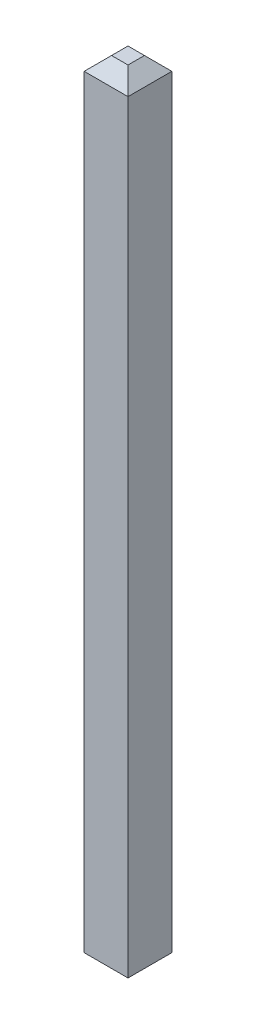
ISO-10303-21;
HEADER;
FILE_DESCRIPTION(('STEP AP214'),'2;1');
FILE_NAME('part.step','',(''),(''),'','','');
FILE_SCHEMA(('AUTOMOTIVE_DESIGN { 1 0 10303 214 1 1 1 1 }'));
ENDSEC;
DATA;
#1=APPLICATION_CONTEXT('core data for automotive mechanical design processes');
#2=APPLICATION_PROTOCOL_DEFINITION('international standard','automotive_design',2000,#1);
#3=PRODUCT_CONTEXT('',#1,'mechanical');
#4=PRODUCT('Part','Part','',(#3));
#5=PRODUCT_RELATED_PRODUCT_CATEGORY('part','',(#4));
#6=PRODUCT_DEFINITION_FORMATION('','',#4);
#7=PRODUCT_DEFINITION_CONTEXT('part definition',#1,'design');
#8=PRODUCT_DEFINITION('design','',#6,#7);
#9=PRODUCT_DEFINITION_SHAPE('','',#8);
#10=(LENGTH_UNIT() NAMED_UNIT(*) SI_UNIT(.MILLI.,.METRE.));
#11=(NAMED_UNIT(*) PLANE_ANGLE_UNIT() SI_UNIT($,.RADIAN.));
#12=(NAMED_UNIT(*) SI_UNIT($,.STERADIAN.) SOLID_ANGLE_UNIT());
#13=UNCERTAINTY_MEASURE_WITH_UNIT(LENGTH_MEASURE(1.E-05),#10,'distance_accuracy_value','');
#14=(GEOMETRIC_REPRESENTATION_CONTEXT(3) GLOBAL_UNCERTAINTY_ASSIGNED_CONTEXT((#13)) GLOBAL_UNIT_ASSIGNED_CONTEXT((#10,
#11,#12)) REPRESENTATION_CONTEXT('',''));
#15=CARTESIAN_POINT('',(0.,0.,0.));
#16=DIRECTION('',(0.,0.,1.));
#17=DIRECTION('',(1.,0.,0.));
#18=AXIS2_PLACEMENT_3D('',#15,#16,#17);
#19=CARTESIAN_POINT('',(9.21,7.07,-0.32));
#20=DIRECTION('',(-0.707106781186548,-0.707106781186548,0.));
#21=DIRECTION('',(-0.707106781186548,0.707106781186548,0.));
#22=AXIS2_PLACEMENT_3D('',#19,#20,#21);
#23=PLANE('',#22);
#24=DIRECTION('',(0.577350269189626,-0.577350269189626,0.577350269189626));
#25=VECTOR('',#24,1.);
#26=CARTESIAN_POINT('',(8.996666666667,7.283333333333,0.106666666667));
#27=LINE('',#26,#25);
#28=CARTESIAN_POINT('',(9.01,7.27,0.12));
#29=VERTEX_POINT('',#28);
#30=CARTESIAN_POINT('',(9.21,7.07,0.32));
#31=VERTEX_POINT('',#30);
#32=EDGE_CURVE('E81',#29,#31,#27,.T.);
#33=ORIENTED_EDGE('',*,*,#32,.T.);
#34=DIRECTION('',(0.,0.,1.));
#35=VECTOR('',#34,1.);
#36=CARTESIAN_POINT('',(9.21,7.07,-0.32));
#37=LINE('',#36,#35);
#38=CARTESIAN_POINT('',(9.21,7.07,-0.32));
#39=VERTEX_POINT('',#38);
#40=EDGE_CURVE('E145',#39,#31,#37,.T.);
#41=ORIENTED_EDGE('',*,*,#40,.F.);
#42=DIRECTION('',(0.577350269189626,-0.577350269189626,-0.577350269189626));
#43=VECTOR('',#42,1.);
#44=CARTESIAN_POINT('',(9.21,7.07,-0.32));
#45=LINE('',#44,#43);
#46=CARTESIAN_POINT('',(9.01,7.27,-0.12));
#47=VERTEX_POINT('',#46);
#48=EDGE_CURVE('E11',#47,#39,#45,.T.);
#49=ORIENTED_EDGE('',*,*,#48,.F.);
#50=DIRECTION('',(0.,0.,-1.));
#51=VECTOR('',#50,1.);
#52=CARTESIAN_POINT('',(9.01,7.27,-0.32));
#53=LINE('',#52,#51);
#54=EDGE_CURVE('E172',#29,#47,#53,.T.);
#55=ORIENTED_EDGE('',*,*,#54,.F.);
#56=EDGE_LOOP('',(#33,#41,#49,#55));
#57=FACE_BOUND('',#56,.T.);
#58=ADVANCED_FACE('F17',(#57),#23,.F.);
#59=CARTESIAN_POINT('',(8.89,7.07,-0.32));
#60=DIRECTION('',(0.,0.707106781186548,-0.707106781186548));
#61=DIRECTION('',(-1.,0.,0.));
#62=AXIS2_PLACEMENT_3D('',#59,#60,#61);
#63=PLANE('',#62);
#64=DIRECTION('',(0.577350269189626,0.577350269189626,0.577350269189626));
#65=VECTOR('',#64,1.);
#66=CARTESIAN_POINT('',(8.703333333333,7.203333333333,-0.186666666667));
#67=LINE('',#66,#65);
#68=CARTESIAN_POINT('',(8.57,7.07,-0.32));
#69=VERTEX_POINT('',#68);
#70=CARTESIAN_POINT('',(8.77,7.27,-0.12));
#71=VERTEX_POINT('',#70);
#72=EDGE_CURVE('E25',#69,#71,#67,.T.);
#73=ORIENTED_EDGE('',*,*,#72,.T.);
#74=DIRECTION('',(-1.,0.,0.));
#75=VECTOR('',#74,1.);
#76=CARTESIAN_POINT('',(8.57,7.27,-0.12));
#77=LINE('',#76,#75);
#78=EDGE_CURVE('E167',#47,#71,#77,.T.);
#79=ORIENTED_EDGE('',*,*,#78,.F.);
#80=ORIENTED_EDGE('',*,*,#48,.T.);
#81=DIRECTION('',(1.,0.,0.));
#82=VECTOR('',#81,1.);
#83=CARTESIAN_POINT('',(9.21,7.07,-0.32));
#84=LINE('',#83,#82);
#85=EDGE_CURVE('E164',#69,#39,#84,.T.);
#86=ORIENTED_EDGE('',*,*,#85,.F.);
#87=EDGE_LOOP('',(#73,#79,#80,#86));
#88=FACE_BOUND('',#87,.T.);
#89=ADVANCED_FACE('F318',(#88),#63,.T.);
#90=CARTESIAN_POINT('',(8.77,7.27,-0.32));
#91=DIRECTION('',(0.707106781186548,-0.707106781186548,0.));
#92=DIRECTION('',(0.,0.,-1.));
#93=AXIS2_PLACEMENT_3D('',#90,#91,#92);
#94=PLANE('',#93);
#95=DIRECTION('',(-0.577350269189626,-0.577350269189626,0.577350269189626));
#96=VECTOR('',#95,1.);
#97=CARTESIAN_POINT('',(8.703333333333,7.203333333333,0.186666666667));
#98=LINE('',#97,#96);
#99=CARTESIAN_POINT('',(8.77,7.27,0.12));
#100=VERTEX_POINT('',#99);
#101=CARTESIAN_POINT('',(8.57,7.07,0.32));
#102=VERTEX_POINT('',#101);
#103=EDGE_CURVE('E37',#100,#102,#98,.T.);
#104=ORIENTED_EDGE('',*,*,#103,.F.);
#105=DIRECTION('',(0.,0.,1.));
#106=VECTOR('',#105,1.);
#107=CARTESIAN_POINT('',(8.77,7.27,-0.32));
#108=LINE('',#107,#106);
#109=EDGE_CURVE('E186',#71,#100,#108,.T.);
#110=ORIENTED_EDGE('',*,*,#109,.F.);
#111=ORIENTED_EDGE('',*,*,#72,.F.);
#112=DIRECTION('',(0.,0.,-1.));
#113=VECTOR('',#112,1.);
#114=CARTESIAN_POINT('',(8.57,7.07,-0.32));
#115=LINE('',#114,#113);
#116=EDGE_CURVE('E148',#102,#69,#115,.T.);
#117=ORIENTED_EDGE('',*,*,#116,.F.);
#118=EDGE_LOOP('',(#104,#110,#111,#117));
#119=FACE_BOUND('',#118,.T.);
#120=ADVANCED_FACE('F149',(#119),#94,.F.);
#121=CARTESIAN_POINT('',(8.57,7.27,0.12));
#122=DIRECTION('',(0.,-0.707106781186548,-0.707106781186548));
#123=DIRECTION('',(0.,-0.707106781186548,0.707106781186548));
#124=AXIS2_PLACEMENT_3D('',#121,#122,#123);
#125=PLANE('',#124);
#126=ORIENTED_EDGE('',*,*,#32,.F.);
#127=DIRECTION('',(1.,0.,0.));
#128=VECTOR('',#127,1.);
#129=CARTESIAN_POINT('',(8.57,7.27,0.12));
#130=LINE('',#129,#128);
#131=EDGE_CURVE('E133',#100,#29,#130,.T.);
#132=ORIENTED_EDGE('',*,*,#131,.F.);
#133=ORIENTED_EDGE('',*,*,#103,.T.);
#134=DIRECTION('',(-1.,0.,0.));
#135=VECTOR('',#134,1.);
#136=CARTESIAN_POINT('',(8.89,7.07,0.32));
#137=LINE('',#136,#135);
#138=EDGE_CURVE('E131',#31,#102,#137,.T.);
#139=ORIENTED_EDGE('',*,*,#138,.F.);
#140=EDGE_LOOP('',(#126,#132,#133,#139));
#141=FACE_BOUND('',#140,.T.);
#142=ADVANCED_FACE('F130',(#141),#125,.F.);
#143=CARTESIAN_POINT('',(8.57,7.27,-0.32));
#144=DIRECTION('',(0.,-1.,0.));
#145=DIRECTION('',(0.,0.,-1.));
#146=AXIS2_PLACEMENT_3D('',#143,#144,#145);
#147=PLANE('',#146);
#148=ORIENTED_EDGE('',*,*,#54,.T.);
#149=ORIENTED_EDGE('',*,*,#78,.T.);
#150=ORIENTED_EDGE('',*,*,#109,.T.);
#151=ORIENTED_EDGE('',*,*,#131,.T.);
#152=EDGE_LOOP('',(#148,#149,#150,#151));
#153=FACE_BOUND('',#152,.T.);
#154=ADVANCED_FACE('F245',(#153),#147,.F.);
#155=CARTESIAN_POINT('',(9.21,7.27,-0.32));
#156=DIRECTION('',(-1.,0.,0.));
#157=DIRECTION('',(0.,1.,0.));
#158=AXIS2_PLACEMENT_3D('',#155,#156,#157);
#159=PLANE('',#158);
#160=DIRECTION('',(0.,-1.,0.));
#161=VECTOR('',#160,1.);
#162=CARTESIAN_POINT('',(9.21,7.27,-0.32));
#163=LINE('',#162,#161);
#164=CARTESIAN_POINT('',(9.21,-4.07,-0.32));
#165=VERTEX_POINT('',#164);
#166=EDGE_CURVE('E158',#39,#165,#163,.T.);
#167=ORIENTED_EDGE('',*,*,#166,.F.);
#168=ORIENTED_EDGE('',*,*,#40,.T.);
#169=DIRECTION('',(0.,-1.,0.));
#170=VECTOR('',#169,1.);
#171=CARTESIAN_POINT('',(9.21,7.27,0.32));
#172=LINE('',#171,#170);
#173=CARTESIAN_POINT('',(9.21,-4.07,0.32));
#174=VERTEX_POINT('',#173);
#175=EDGE_CURVE('E143',#31,#174,#172,.T.);
#176=ORIENTED_EDGE('',*,*,#175,.T.);
#177=DIRECTION('',(0.,0.,-1.));
#178=VECTOR('',#177,1.);
#179=CARTESIAN_POINT('',(9.21,-4.07,-0.32));
#180=LINE('',#179,#178);
#181=EDGE_CURVE('E178',#174,#165,#180,.T.);
#182=ORIENTED_EDGE('',*,*,#181,.T.);
#183=EDGE_LOOP('',(#167,#168,#176,#182));
#184=FACE_BOUND('',#183,.T.);
#185=ADVANCED_FACE('F205',(#184),#159,.F.);
#186=CARTESIAN_POINT('',(8.89,1.5,0.32));
#187=DIRECTION('',(0.,0.,-1.));
#188=DIRECTION('',(0.,-1.,0.));
#189=AXIS2_PLACEMENT_3D('',#186,#187,#188);
#190=PLANE('',#189);
#191=ORIENTED_EDGE('',*,*,#175,.F.);
#192=ORIENTED_EDGE('',*,*,#138,.T.);
#193=DIRECTION('',(0.,1.,0.));
#194=VECTOR('',#193,1.);
#195=CARTESIAN_POINT('',(8.57,-4.27,0.32));
#196=LINE('',#195,#194);
#197=CARTESIAN_POINT('',(8.57,-4.07,0.32));
#198=VERTEX_POINT('',#197);
#199=EDGE_CURVE('E142',#198,#102,#196,.T.);
#200=ORIENTED_EDGE('',*,*,#199,.F.);
#201=DIRECTION('',(1.,0.,0.));
#202=VECTOR('',#201,1.);
#203=CARTESIAN_POINT('',(8.89,-4.07,0.32));
#204=LINE('',#203,#202);
#205=EDGE_CURVE('E175',#198,#174,#204,.T.);
#206=ORIENTED_EDGE('',*,*,#205,.T.);
#207=EDGE_LOOP('',(#191,#192,#200,#206));
#208=FACE_BOUND('',#207,.T.);
#209=ADVANCED_FACE('F139',(#208),#190,.F.);
#210=CARTESIAN_POINT('',(9.01,-4.27,-0.32));
#211=DIRECTION('',(-0.707106781186548,0.707106781186548,0.));
#212=DIRECTION('',(0.,0.,1.));
#213=AXIS2_PLACEMENT_3D('',#210,#211,#212);
#214=PLANE('',#213);
#215=DIRECTION('',(-0.577350269189626,-0.577350269189626,0.577350269189626));
#216=VECTOR('',#215,1.);
#217=CARTESIAN_POINT('',(9.076666666667,-4.203333333333,-0.186666666667));
#218=LINE('',#217,#216);
#219=CARTESIAN_POINT('',(9.01,-4.27,-0.12));
#220=VERTEX_POINT('',#219);
#221=EDGE_CURVE('E122',#165,#220,#218,.T.);
#222=ORIENTED_EDGE('',*,*,#221,.F.);
#223=ORIENTED_EDGE('',*,*,#181,.F.);
#224=DIRECTION('',(-0.577350269189626,-0.577350269189626,-0.577350269189626));
#225=VECTOR('',#224,1.);
#226=CARTESIAN_POINT('',(8.863333333333,-4.416666666667,-0.02666666666667));
#227=LINE('',#226,#225);
#228=CARTESIAN_POINT('',(9.01,-4.27,0.12));
#229=VERTEX_POINT('',#228);
#230=EDGE_CURVE('E114',#174,#229,#227,.T.);
#231=ORIENTED_EDGE('',*,*,#230,.T.);
#232=DIRECTION('',(0.,0.,1.));
#233=VECTOR('',#232,1.);
#234=CARTESIAN_POINT('',(9.01,-4.27,-0.32));
#235=LINE('',#234,#233);
#236=EDGE_CURVE('E397',#220,#229,#235,.T.);
#237=ORIENTED_EDGE('',*,*,#236,.F.);
#238=EDGE_LOOP('',(#222,#223,#231,#237));
#239=FACE_BOUND('',#238,.T.);
#240=ADVANCED_FACE('F204',(#239),#214,.F.);
#241=CARTESIAN_POINT('',(9.21,-4.27,0.12));
#242=DIRECTION('',(0.,0.707106781186548,-0.707106781186548));
#243=DIRECTION('',(-1.,0.,0.));
#244=AXIS2_PLACEMENT_3D('',#241,#242,#243);
#245=PLANE('',#244);
#246=ORIENTED_EDGE('',*,*,#230,.F.);
#247=ORIENTED_EDGE('',*,*,#205,.F.);
#248=DIRECTION('',(-0.577350269189626,0.577350269189626,0.577350269189626));
#249=VECTOR('',#248,1.);
#250=CARTESIAN_POINT('',(8.783333333333,-4.283333333333,0.106666666667));
#251=LINE('',#250,#249);
#252=CARTESIAN_POINT('',(8.77,-4.27,0.12));
#253=VERTEX_POINT('',#252);
#254=EDGE_CURVE('E103',#253,#198,#251,.T.);
#255=ORIENTED_EDGE('',*,*,#254,.F.);
#256=DIRECTION('',(-1.,0.,0.));
#257=VECTOR('',#256,1.);
#258=CARTESIAN_POINT('',(9.21,-4.27,0.12));
#259=LINE('',#258,#257);
#260=EDGE_CURVE('E392',#229,#253,#259,.T.);
#261=ORIENTED_EDGE('',*,*,#260,.F.);
#262=EDGE_LOOP('',(#246,#247,#255,#261));
#263=FACE_BOUND('',#262,.T.);
#264=ADVANCED_FACE('F220',(#263),#245,.F.);
#265=CARTESIAN_POINT('',(8.57,-4.07,-0.32));
#266=DIRECTION('',(0.707106781186548,0.707106781186548,0.));
#267=DIRECTION('',(0.,0.,-1.));
#268=AXIS2_PLACEMENT_3D('',#265,#266,#267);
#269=PLANE('',#268);
#270=DIRECTION('',(0.577350269189626,-0.577350269189626,0.577350269189626));
#271=VECTOR('',#270,1.);
#272=CARTESIAN_POINT('',(8.676666666667,-4.176666666667,-0.213333333333));
#273=LINE('',#272,#271);
#274=CARTESIAN_POINT('',(8.57,-4.07,-0.32));
#275=VERTEX_POINT('',#274);
#276=CARTESIAN_POINT('',(8.77,-4.27,-0.12));
#277=VERTEX_POINT('',#276);
#278=EDGE_CURVE('E375',#275,#277,#273,.T.);
#279=ORIENTED_EDGE('',*,*,#278,.T.);
#280=DIRECTION('',(0.,0.,-1.));
#281=VECTOR('',#280,1.);
#282=CARTESIAN_POINT('',(8.77,-4.27,-0.32));
#283=LINE('',#282,#281);
#284=EDGE_CURVE('E385',#253,#277,#283,.T.);
#285=ORIENTED_EDGE('',*,*,#284,.F.);
#286=ORIENTED_EDGE('',*,*,#254,.T.);
#287=DIRECTION('',(0.,0.,1.));
#288=VECTOR('',#287,1.);
#289=CARTESIAN_POINT('',(8.57,-4.07,-0.32));
#290=LINE('',#289,#288);
#291=EDGE_CURVE('E153',#275,#198,#290,.T.);
#292=ORIENTED_EDGE('',*,*,#291,.F.);
#293=EDGE_LOOP('',(#279,#285,#286,#292));
#294=FACE_BOUND('',#293,.T.);
#295=ADVANCED_FACE('F215',(#294),#269,.F.);
#296=CARTESIAN_POINT('',(8.57,-4.27,-0.32));
#297=DIRECTION('',(1.,0.,0.));
#298=DIRECTION('',(0.,0.,1.));
#299=AXIS2_PLACEMENT_3D('',#296,#297,#298);
#300=PLANE('',#299);
#301=ORIENTED_EDGE('',*,*,#199,.T.);
#302=ORIENTED_EDGE('',*,*,#116,.T.);
#303=DIRECTION('',(0.,1.,0.));
#304=VECTOR('',#303,1.);
#305=CARTESIAN_POINT('',(8.57,-4.27,-0.32));
#306=LINE('',#305,#304);
#307=EDGE_CURVE('E363',#275,#69,#306,.T.);
#308=ORIENTED_EDGE('',*,*,#307,.F.);
#309=ORIENTED_EDGE('',*,*,#291,.T.);
#310=EDGE_LOOP('',(#301,#302,#308,#309));
#311=FACE_BOUND('',#310,.T.);
#312=ADVANCED_FACE('F156',(#311),#300,.F.);
#313=CARTESIAN_POINT('',(8.89,1.5,-0.32));
#314=DIRECTION('',(0.,0.,-1.));
#315=DIRECTION('',(0.,-1.,0.));
#316=AXIS2_PLACEMENT_3D('',#313,#314,#315);
#317=PLANE('',#316);
#318=ORIENTED_EDGE('',*,*,#307,.T.);
#319=ORIENTED_EDGE('',*,*,#85,.T.);
#320=ORIENTED_EDGE('',*,*,#166,.T.);
#321=DIRECTION('',(-1.,0.,0.));
#322=VECTOR('',#321,1.);
#323=CARTESIAN_POINT('',(8.57,-4.07,-0.32));
#324=LINE('',#323,#322);
#325=EDGE_CURVE('E364',#165,#275,#324,.T.);
#326=ORIENTED_EDGE('',*,*,#325,.T.);
#327=EDGE_LOOP('',(#318,#319,#320,#326));
#328=FACE_BOUND('',#327,.T.);
#329=ADVANCED_FACE('F256',(#328),#317,.T.);
#330=CARTESIAN_POINT('',(8.89,-4.07,-0.32));
#331=DIRECTION('',(0.,-0.707106781186548,-0.707106781186548));
#332=DIRECTION('',(0.,-0.707106781186548,0.707106781186548));
#333=AXIS2_PLACEMENT_3D('',#330,#331,#332);
#334=PLANE('',#333);
#335=ORIENTED_EDGE('',*,*,#278,.F.);
#336=ORIENTED_EDGE('',*,*,#325,.F.);
#337=ORIENTED_EDGE('',*,*,#221,.T.);
#338=DIRECTION('',(1.,0.,0.));
#339=VECTOR('',#338,1.);
#340=CARTESIAN_POINT('',(9.21,-4.27,-0.12));
#341=LINE('',#340,#339);
#342=EDGE_CURVE('E382',#277,#220,#341,.T.);
#343=ORIENTED_EDGE('',*,*,#342,.F.);
#344=EDGE_LOOP('',(#335,#336,#337,#343));
#345=FACE_BOUND('',#344,.T.);
#346=ADVANCED_FACE('F234',(#345),#334,.T.);
#347=CARTESIAN_POINT('',(9.21,-4.27,-0.32));
#348=DIRECTION('',(0.,1.,0.));
#349=DIRECTION('',(0.,0.,-1.));
#350=AXIS2_PLACEMENT_3D('',#347,#348,#349);
#351=PLANE('',#350);
#352=ORIENTED_EDGE('',*,*,#236,.T.);
#353=ORIENTED_EDGE('',*,*,#260,.T.);
#354=ORIENTED_EDGE('',*,*,#284,.T.);
#355=ORIENTED_EDGE('',*,*,#342,.T.);
#356=EDGE_LOOP('',(#352,#353,#354,#355));
#357=FACE_BOUND('',#356,.T.);
#358=ADVANCED_FACE('F229',(#357),#351,.F.);
#359=CLOSED_SHELL('',(#58,#89,#120,#142,#154,#185,#209,#240,#264,#295,#312,#329,#346,#358));
#360=MANIFOLD_SOLID_BREP('B1',#359);
#361=ADVANCED_BREP_SHAPE_REPRESENTATION('',(#18,#360),#14);
#362=SHAPE_DEFINITION_REPRESENTATION(#9,#361);
ENDSEC;
END-ISO-10303-21;
